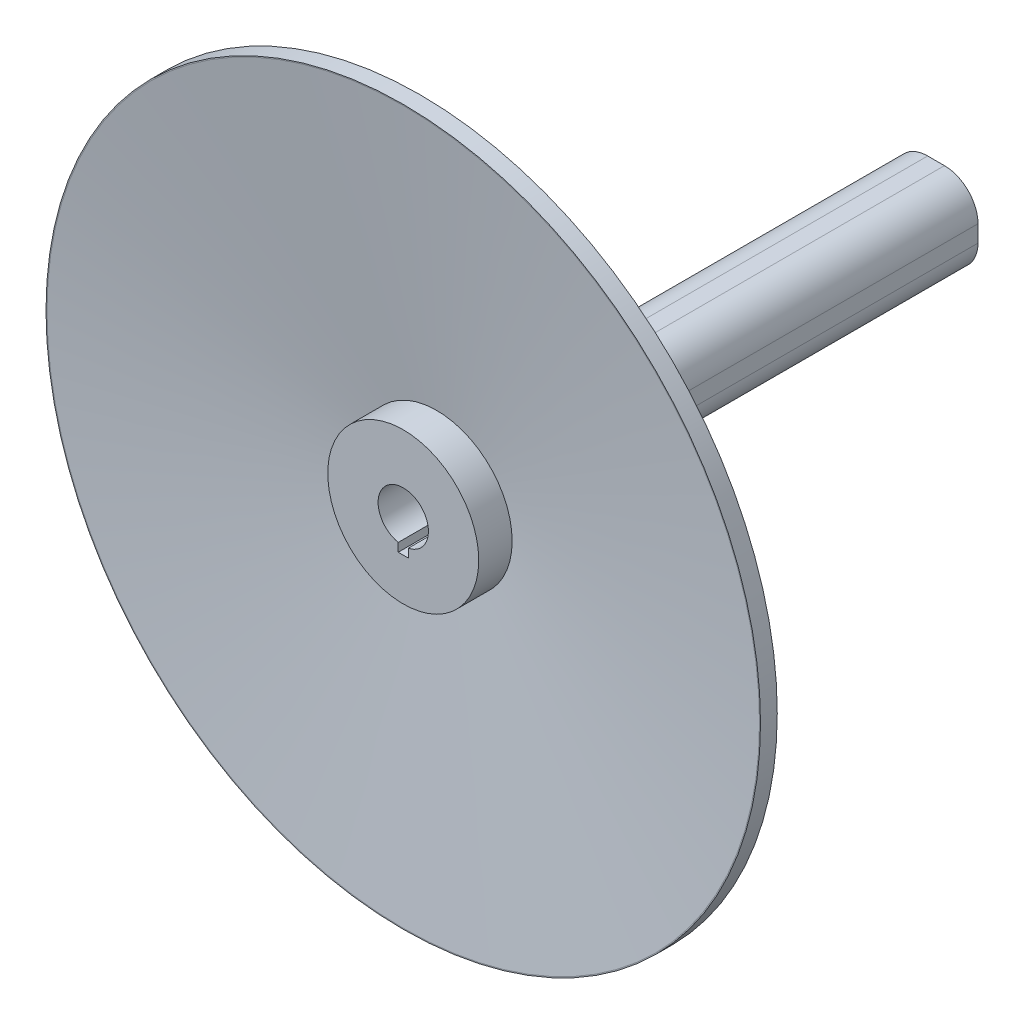
ISO-10303-21;
HEADER;
FILE_DESCRIPTION(('STEP AP214'),'2;1');
FILE_NAME('part.step','',(''),(''),'','','');
FILE_SCHEMA(('AUTOMOTIVE_DESIGN { 1 0 10303 214 1 1 1 1 }'));
ENDSEC;
DATA;
#1=APPLICATION_CONTEXT('core data for automotive mechanical design processes');
#2=APPLICATION_PROTOCOL_DEFINITION('international standard','automotive_design',2000,#1);
#3=PRODUCT_CONTEXT('',#1,'mechanical');
#4=PRODUCT('Part','Part','',(#3));
#5=PRODUCT_RELATED_PRODUCT_CATEGORY('part','',(#4));
#6=PRODUCT_DEFINITION_FORMATION('','',#4);
#7=PRODUCT_DEFINITION_CONTEXT('part definition',#1,'design');
#8=PRODUCT_DEFINITION('design','',#6,#7);
#9=PRODUCT_DEFINITION_SHAPE('','',#8);
#10=(LENGTH_UNIT() NAMED_UNIT(*) SI_UNIT(.MILLI.,.METRE.));
#11=(NAMED_UNIT(*) PLANE_ANGLE_UNIT() SI_UNIT($,.RADIAN.));
#12=(NAMED_UNIT(*) SI_UNIT($,.STERADIAN.) SOLID_ANGLE_UNIT());
#13=UNCERTAINTY_MEASURE_WITH_UNIT(LENGTH_MEASURE(1.E-05),#10,'distance_accuracy_value','');
#14=(GEOMETRIC_REPRESENTATION_CONTEXT(3) GLOBAL_UNCERTAINTY_ASSIGNED_CONTEXT((#13)) GLOBAL_UNIT_ASSIGNED_CONTEXT((#10,
#11,#12)) REPRESENTATION_CONTEXT('',''));
#15=CARTESIAN_POINT('',(0.,0.,0.));
#16=DIRECTION('',(0.,0.,1.));
#17=DIRECTION('',(1.,0.,0.));
#18=AXIS2_PLACEMENT_3D('',#15,#16,#17);
#19=CARTESIAN_POINT('',(0.,0.,60.));
#20=DIRECTION('',(0.,0.,1.));
#21=DIRECTION('',(1.,0.,0.));
#22=AXIS2_PLACEMENT_3D('',#19,#20,#21);
#23=PLANE('',#22);
#24=CARTESIAN_POINT('',(0.,0.,60.));
#25=DIRECTION('',(0.,0.,1.));
#26=DIRECTION('',(1.,0.,0.));
#27=AXIS2_PLACEMENT_3D('',#24,#25,#26);
#28=CIRCLE('',#27,22.5);
#29=CARTESIAN_POINT('',(22.5,0.,60.));
#30=VERTEX_POINT('',#29);
#31=EDGE_CURVE('E47',#30,#30,#28,.T.);
#32=ORIENTED_EDGE('',*,*,#31,.T.);
#33=EDGE_LOOP('',(#32));
#34=FACE_BOUND('',#33,.T.);
#35=CARTESIAN_POINT('',(0.,0.,60.));
#36=DIRECTION('',(0.,0.,-1.));
#37=DIRECTION('',(-1.,0.,0.));
#38=AXIS2_PLACEMENT_3D('',#35,#36,#37);
#39=CIRCLE('',#38,7.5);
#40=CARTESIAN_POINT('',(-1.5,-7.34846922834953,60.));
#41=VERTEX_POINT('',#40);
#42=CARTESIAN_POINT('',(1.5,-7.34846922834953,60.));
#43=VERTEX_POINT('',#42);
#44=EDGE_CURVE('E147',#41,#43,#39,.T.);
#45=ORIENTED_EDGE('',*,*,#44,.T.);
#46=DIRECTION('',(0.,-1.,0.));
#47=VECTOR('',#46,1.);
#48=CARTESIAN_POINT('',(1.5,0.,60.));
#49=LINE('',#48,#47);
#50=CARTESIAN_POINT('',(1.5,-9.88685996664259,60.));
#51=VERTEX_POINT('',#50);
#52=EDGE_CURVE('E483',#43,#51,#49,.T.);
#53=ORIENTED_EDGE('',*,*,#52,.T.);
#54=DIRECTION('',(1.,0.,0.));
#55=VECTOR('',#54,1.);
#56=CARTESIAN_POINT('',(0.,-9.88685996664259,60.));
#57=LINE('',#56,#55);
#58=CARTESIAN_POINT('',(-1.5,-9.88685996664259,60.));
#59=VERTEX_POINT('',#58);
#60=EDGE_CURVE('E479',#59,#51,#57,.T.);
#61=ORIENTED_EDGE('',*,*,#60,.F.);
#62=DIRECTION('',(0.,-1.,0.));
#63=VECTOR('',#62,1.);
#64=CARTESIAN_POINT('',(-1.5,0.,60.));
#65=LINE('',#64,#63);
#66=EDGE_CURVE('E481',#41,#59,#65,.T.);
#67=ORIENTED_EDGE('',*,*,#66,.F.);
#68=EDGE_LOOP('',(#45,#53,#61,#67));
#69=FACE_BOUND('',#68,.T.);
#70=ADVANCED_FACE('F39',(#34,#69),#23,.T.);
#71=CARTESIAN_POINT('',(0.,0.,60.));
#72=DIRECTION('',(0.,0.,-1.));
#73=DIRECTION('',(-1.,0.,0.));
#74=AXIS2_PLACEMENT_3D('',#71,#72,#73);
#75=CYLINDRICAL_SURFACE('',#74,7.5);
#76=CARTESIAN_POINT('',(0.,0.,-98.836337037247));
#77=DIRECTION('',(0.,0.,-1.));
#78=DIRECTION('',(-1.,0.,0.));
#79=AXIS2_PLACEMENT_3D('',#76,#77,#78);
#80=CIRCLE('',#79,7.5);
#81=CARTESIAN_POINT('',(-7.5,0.,-98.836337037247));
#82=VERTEX_POINT('',#81);
#83=EDGE_CURVE('E157',#82,#82,#80,.T.);
#84=ORIENTED_EDGE('',*,*,#83,.T.);
#85=EDGE_LOOP('',(#84));
#86=FACE_BOUND('',#85,.T.);
#87=DIRECTION('',(0.,0.,1.));
#88=VECTOR('',#87,1.);
#89=CARTESIAN_POINT('',(1.5,-7.34846922834953,9.99999999999999));
#90=LINE('',#89,#88);
#91=CARTESIAN_POINT('',(1.5,-7.34846922834953,9.99999999999999));
#92=VERTEX_POINT('',#91);
#93=EDGE_CURVE('E148',#92,#43,#90,.T.);
#94=ORIENTED_EDGE('',*,*,#93,.T.);
#95=ORIENTED_EDGE('',*,*,#44,.F.);
#96=DIRECTION('',(0.,0.,1.));
#97=VECTOR('',#96,1.);
#98=CARTESIAN_POINT('',(-1.5,-7.34846922834953,9.99999999999999));
#99=LINE('',#98,#97);
#100=CARTESIAN_POINT('',(-1.5,-7.34846922834953,9.99999999999999));
#101=VERTEX_POINT('',#100);
#102=EDGE_CURVE('E132',#101,#41,#99,.T.);
#103=ORIENTED_EDGE('',*,*,#102,.F.);
#104=CARTESIAN_POINT('',(0.,0.,9.99999999999999));
#105=DIRECTION('',(0.,0.,1.));
#106=DIRECTION('',(1.,0.,0.));
#107=AXIS2_PLACEMENT_3D('',#104,#105,#106);
#108=CIRCLE('',#107,7.5);
#109=EDGE_CURVE('E137',#92,#101,#108,.F.);
#110=ORIENTED_EDGE('',*,*,#109,.F.);
#111=EDGE_LOOP('',(#94,#95,#103,#110));
#112=FACE_BOUND('',#111,.T.);
#113=ADVANCED_FACE('F145',(#86,#112),#75,.F.);
#114=CARTESIAN_POINT('',(0.,0.,0.));
#115=DIRECTION('',(0.,0.,1.));
#116=DIRECTION('',(1.,0.,0.));
#117=AXIS2_PLACEMENT_3D('',#114,#115,#116);
#118=PLANE('',#117);
#119=CARTESIAN_POINT('',(0.,0.,0.));
#120=DIRECTION('',(0.,0.,1.));
#121=DIRECTION('',(1.,0.,0.));
#122=AXIS2_PLACEMENT_3D('',#119,#120,#121);
#123=CIRCLE('',#122,22.5);
#124=CARTESIAN_POINT('',(22.5,0.,0.));
#125=VERTEX_POINT('',#124);
#126=EDGE_CURVE('E233',#125,#125,#123,.T.);
#127=ORIENTED_EDGE('',*,*,#126,.F.);
#128=EDGE_LOOP('',(#127));
#129=FACE_BOUND('',#128,.T.);
#130=CARTESIAN_POINT('',(2.5,-2.5,0.));
#131=DIRECTION('',(0.,0.,-1.));
#132=DIRECTION('',(-1.,0.,0.));
#133=AXIS2_PLACEMENT_3D('',#130,#131,#132);
#134=CIRCLE('',#133,10.);
#135=CARTESIAN_POINT('',(12.5,-2.49999999999993,0.));
#136=VERTEX_POINT('',#135);
#137=CARTESIAN_POINT('',(2.49999999999993,-12.5,0.));
#138=VERTEX_POINT('',#137);
#139=EDGE_CURVE('E62',#136,#138,#134,.T.);
#140=ORIENTED_EDGE('',*,*,#139,.F.);
#141=DIRECTION('',(0.,-1.,0.));
#142=VECTOR('',#141,1.);
#143=CARTESIAN_POINT('',(12.5,2.49999999999993,0.));
#144=LINE('',#143,#142);
#145=CARTESIAN_POINT('',(12.5,2.49999999999993,0.));
#146=VERTEX_POINT('',#145);
#147=EDGE_CURVE('E175',#146,#136,#144,.T.);
#148=ORIENTED_EDGE('',*,*,#147,.F.);
#149=CARTESIAN_POINT('',(2.5,2.5,0.));
#150=DIRECTION('',(0.,0.,-1.));
#151=DIRECTION('',(-1.,0.,0.));
#152=AXIS2_PLACEMENT_3D('',#149,#150,#151);
#153=CIRCLE('',#152,10.);
#154=CARTESIAN_POINT('',(2.49999999999993,12.5,0.));
#155=VERTEX_POINT('',#154);
#156=EDGE_CURVE('E206',#155,#146,#153,.T.);
#157=ORIENTED_EDGE('',*,*,#156,.F.);
#158=DIRECTION('',(1.,0.,0.));
#159=VECTOR('',#158,1.);
#160=CARTESIAN_POINT('',(2.49999999999993,12.5,0.));
#161=LINE('',#160,#159);
#162=CARTESIAN_POINT('',(-2.49999999999993,12.5,0.));
#163=VERTEX_POINT('',#162);
#164=EDGE_CURVE('E203',#163,#155,#161,.T.);
#165=ORIENTED_EDGE('',*,*,#164,.F.);
#166=CARTESIAN_POINT('',(-2.5,2.5,0.));
#167=DIRECTION('',(0.,0.,-1.));
#168=DIRECTION('',(1.,0.,0.));
#169=AXIS2_PLACEMENT_3D('',#166,#167,#168);
#170=CIRCLE('',#169,10.);
#171=CARTESIAN_POINT('',(-12.5,2.49999999999994,0.));
#172=VERTEX_POINT('',#171);
#173=EDGE_CURVE('E200',#172,#163,#170,.T.);
#174=ORIENTED_EDGE('',*,*,#173,.F.);
#175=DIRECTION('',(0.,1.,0.));
#176=VECTOR('',#175,1.);
#177=CARTESIAN_POINT('',(-12.5,2.49999999999993,0.));
#178=LINE('',#177,#176);
#179=CARTESIAN_POINT('',(-12.5,-2.49999999999993,0.));
#180=VERTEX_POINT('',#179);
#181=EDGE_CURVE('E197',#180,#172,#178,.T.);
#182=ORIENTED_EDGE('',*,*,#181,.F.);
#183=CARTESIAN_POINT('',(-2.5,-2.5,0.));
#184=DIRECTION('',(0.,0.,-1.));
#185=DIRECTION('',(-1.,0.,0.));
#186=AXIS2_PLACEMENT_3D('',#183,#184,#185);
#187=CIRCLE('',#186,10.);
#188=CARTESIAN_POINT('',(-2.49999999999993,-12.5,0.));
#189=VERTEX_POINT('',#188);
#190=EDGE_CURVE('E194',#189,#180,#187,.T.);
#191=ORIENTED_EDGE('',*,*,#190,.F.);
#192=DIRECTION('',(-1.,0.,0.));
#193=VECTOR('',#192,1.);
#194=CARTESIAN_POINT('',(2.49999999999993,-12.5,0.));
#195=LINE('',#194,#193);
#196=EDGE_CURVE('E191',#138,#189,#195,.T.);
#197=ORIENTED_EDGE('',*,*,#196,.F.);
#198=EDGE_LOOP('',(#140,#148,#157,#165,#174,#182,#191,#197));
#199=FACE_BOUND('',#198,.T.);
#200=ADVANCED_FACE('F239',(#129,#199),#118,.F.);
#201=CARTESIAN_POINT('',(0.,0.,60.));
#202=DIRECTION('',(0.,0.,-1.));
#203=DIRECTION('',(-1.,0.,0.));
#204=AXIS2_PLACEMENT_3D('',#201,#202,#203);
#205=CYLINDRICAL_SURFACE('',#204,22.5);
#206=CARTESIAN_POINT('',(0.,0.,45.));
#207=DIRECTION('',(0.,0.,1.));
#208=DIRECTION('',(1.,0.,0.));
#209=AXIS2_PLACEMENT_3D('',#206,#207,#208);
#210=CIRCLE('',#209,22.5);
#211=CARTESIAN_POINT('',(22.5,0.,45.));
#212=VERTEX_POINT('',#211);
#213=EDGE_CURVE('E165',#212,#212,#210,.T.);
#214=ORIENTED_EDGE('',*,*,#213,.F.);
#215=EDGE_LOOP('',(#214));
#216=FACE_BOUND('',#215,.T.);
#217=ORIENTED_EDGE('',*,*,#126,.T.);
#218=EDGE_LOOP('',(#217));
#219=FACE_BOUND('',#218,.T.);
#220=ADVANCED_FACE('F41',(#216,#219),#205,.T.);
#221=CARTESIAN_POINT('',(2.5,-2.5,-98.836337037247));
#222=DIRECTION('',(0.,0.,1.));
#223=DIRECTION('',(1.,0.,0.));
#224=AXIS2_PLACEMENT_3D('',#221,#222,#223);
#225=CYLINDRICAL_SURFACE('',#224,10.);
#226=ORIENTED_EDGE('',*,*,#139,.T.);
#227=DIRECTION('',(0.,0.,1.));
#228=VECTOR('',#227,1.);
#229=CARTESIAN_POINT('',(2.49999999999993,-12.5,-98.836337037247));
#230=LINE('',#229,#228);
#231=CARTESIAN_POINT('',(2.49999999999993,-12.5,-98.836337037247));
#232=VERTEX_POINT('',#231);
#233=EDGE_CURVE('E230',#232,#138,#230,.T.);
#234=ORIENTED_EDGE('',*,*,#233,.F.);
#235=CARTESIAN_POINT('',(2.5,-2.5,-98.836337037247));
#236=DIRECTION('',(0.,0.,-1.));
#237=DIRECTION('',(-1.,0.,0.));
#238=AXIS2_PLACEMENT_3D('',#235,#236,#237);
#239=CIRCLE('',#238,10.);
#240=CARTESIAN_POINT('',(12.5,-2.49999999999993,-98.836337037247));
#241=VERTEX_POINT('',#240);
#242=EDGE_CURVE('E171',#241,#232,#239,.T.);
#243=ORIENTED_EDGE('',*,*,#242,.F.);
#244=DIRECTION('',(0.,0.,1.));
#245=VECTOR('',#244,1.);
#246=CARTESIAN_POINT('',(12.5,-2.49999999999993,-98.836337037247));
#247=LINE('',#246,#245);
#248=EDGE_CURVE('E189',#241,#136,#247,.T.);
#249=ORIENTED_EDGE('',*,*,#248,.T.);
#250=EDGE_LOOP('',(#226,#234,#243,#249));
#251=FACE_BOUND('',#250,.T.);
#252=ADVANCED_FACE('F245',(#251),#225,.T.);
#253=CARTESIAN_POINT('',(2.49999999999993,-12.5,-98.836337037247));
#254=DIRECTION('',(0.,1.,0.));
#255=DIRECTION('',(0.,0.,1.));
#256=AXIS2_PLACEMENT_3D('',#253,#254,#255);
#257=PLANE('',#256);
#258=ORIENTED_EDGE('',*,*,#196,.T.);
#259=DIRECTION('',(0.,0.,1.));
#260=VECTOR('',#259,1.);
#261=CARTESIAN_POINT('',(-2.49999999999993,-12.5,-98.836337037247));
#262=LINE('',#261,#260);
#263=CARTESIAN_POINT('',(-2.49999999999993,-12.5,-98.836337037247));
#264=VERTEX_POINT('',#263);
#265=EDGE_CURVE('E227',#264,#189,#262,.T.);
#266=ORIENTED_EDGE('',*,*,#265,.F.);
#267=DIRECTION('',(-1.,0.,0.));
#268=VECTOR('',#267,1.);
#269=CARTESIAN_POINT('',(2.49999999999993,-12.5,-98.836337037247));
#270=LINE('',#269,#268);
#271=EDGE_CURVE('E174',#232,#264,#270,.T.);
#272=ORIENTED_EDGE('',*,*,#271,.F.);
#273=ORIENTED_EDGE('',*,*,#233,.T.);
#274=EDGE_LOOP('',(#258,#266,#272,#273));
#275=FACE_BOUND('',#274,.T.);
#276=ADVANCED_FACE('F259',(#275),#257,.F.);
#277=CARTESIAN_POINT('',(-2.5,-2.5,-98.836337037247));
#278=DIRECTION('',(0.,0.,1.));
#279=DIRECTION('',(1.,0.,0.));
#280=AXIS2_PLACEMENT_3D('',#277,#278,#279);
#281=CYLINDRICAL_SURFACE('',#280,10.);
#282=ORIENTED_EDGE('',*,*,#190,.T.);
#283=DIRECTION('',(0.,0.,1.));
#284=VECTOR('',#283,1.);
#285=CARTESIAN_POINT('',(-12.5,-2.49999999999993,-98.836337037247));
#286=LINE('',#285,#284);
#287=CARTESIAN_POINT('',(-12.5,-2.49999999999993,-98.836337037247));
#288=VERTEX_POINT('',#287);
#289=EDGE_CURVE('E224',#288,#180,#286,.T.);
#290=ORIENTED_EDGE('',*,*,#289,.F.);
#291=CARTESIAN_POINT('',(-2.5,-2.5,-98.836337037247));
#292=DIRECTION('',(0.,0.,-1.));
#293=DIRECTION('',(-1.,0.,0.));
#294=AXIS2_PLACEMENT_3D('',#291,#292,#293);
#295=CIRCLE('',#294,10.);
#296=EDGE_CURVE('E177',#264,#288,#295,.T.);
#297=ORIENTED_EDGE('',*,*,#296,.F.);
#298=ORIENTED_EDGE('',*,*,#265,.T.);
#299=EDGE_LOOP('',(#282,#290,#297,#298));
#300=FACE_BOUND('',#299,.T.);
#301=ADVANCED_FACE('F263',(#300),#281,.T.);
#302=CARTESIAN_POINT('',(-12.5,2.49999999999993,-98.836337037247));
#303=DIRECTION('',(1.,0.,0.));
#304=DIRECTION('',(0.,0.,-1.));
#305=AXIS2_PLACEMENT_3D('',#302,#303,#304);
#306=PLANE('',#305);
#307=ORIENTED_EDGE('',*,*,#181,.T.);
#308=DIRECTION('',(0.,0.,1.));
#309=VECTOR('',#308,1.);
#310=CARTESIAN_POINT('',(-12.5,2.49999999999994,-98.836337037247));
#311=LINE('',#310,#309);
#312=CARTESIAN_POINT('',(-12.5,2.49999999999994,-98.836337037247));
#313=VERTEX_POINT('',#312);
#314=EDGE_CURVE('E221',#313,#172,#311,.T.);
#315=ORIENTED_EDGE('',*,*,#314,.F.);
#316=DIRECTION('',(0.,1.,0.));
#317=VECTOR('',#316,1.);
#318=CARTESIAN_POINT('',(-12.5,2.49999999999993,-98.836337037247));
#319=LINE('',#318,#317);
#320=EDGE_CURVE('E179',#288,#313,#319,.T.);
#321=ORIENTED_EDGE('',*,*,#320,.F.);
#322=ORIENTED_EDGE('',*,*,#289,.T.);
#323=EDGE_LOOP('',(#307,#315,#321,#322));
#324=FACE_BOUND('',#323,.T.);
#325=ADVANCED_FACE('F267',(#324),#306,.F.);
#326=CARTESIAN_POINT('',(-2.5,2.5,-98.836337037247));
#327=DIRECTION('',(0.,0.,1.));
#328=DIRECTION('',(1.,0.,0.));
#329=AXIS2_PLACEMENT_3D('',#326,#327,#328);
#330=CYLINDRICAL_SURFACE('',#329,10.);
#331=ORIENTED_EDGE('',*,*,#173,.T.);
#332=DIRECTION('',(0.,0.,1.));
#333=VECTOR('',#332,1.);
#334=CARTESIAN_POINT('',(-2.49999999999993,12.5,-98.836337037247));
#335=LINE('',#334,#333);
#336=CARTESIAN_POINT('',(-2.49999999999993,12.5,-98.836337037247));
#337=VERTEX_POINT('',#336);
#338=EDGE_CURVE('E218',#337,#163,#335,.T.);
#339=ORIENTED_EDGE('',*,*,#338,.F.);
#340=CARTESIAN_POINT('',(-2.5,2.5,-98.836337037247));
#341=DIRECTION('',(0.,0.,-1.));
#342=DIRECTION('',(1.,0.,0.));
#343=AXIS2_PLACEMENT_3D('',#340,#341,#342);
#344=CIRCLE('',#343,10.);
#345=EDGE_CURVE('E181',#313,#337,#344,.T.);
#346=ORIENTED_EDGE('',*,*,#345,.F.);
#347=ORIENTED_EDGE('',*,*,#314,.T.);
#348=EDGE_LOOP('',(#331,#339,#346,#347));
#349=FACE_BOUND('',#348,.T.);
#350=ADVANCED_FACE('F271',(#349),#330,.T.);
#351=CARTESIAN_POINT('',(2.49999999999993,12.5,-98.836337037247));
#352=DIRECTION('',(0.,-1.,0.));
#353=DIRECTION('',(0.,0.,-1.));
#354=AXIS2_PLACEMENT_3D('',#351,#352,#353);
#355=PLANE('',#354);
#356=ORIENTED_EDGE('',*,*,#164,.T.);
#357=DIRECTION('',(0.,0.,1.));
#358=VECTOR('',#357,1.);
#359=CARTESIAN_POINT('',(2.49999999999993,12.5,-98.836337037247));
#360=LINE('',#359,#358);
#361=CARTESIAN_POINT('',(2.49999999999993,12.5,-98.836337037247));
#362=VERTEX_POINT('',#361);
#363=EDGE_CURVE('E215',#362,#155,#360,.T.);
#364=ORIENTED_EDGE('',*,*,#363,.F.);
#365=DIRECTION('',(1.,0.,0.));
#366=VECTOR('',#365,1.);
#367=CARTESIAN_POINT('',(2.49999999999993,12.5,-98.836337037247));
#368=LINE('',#367,#366);
#369=EDGE_CURVE('E183',#337,#362,#368,.T.);
#370=ORIENTED_EDGE('',*,*,#369,.F.);
#371=ORIENTED_EDGE('',*,*,#338,.T.);
#372=EDGE_LOOP('',(#356,#364,#370,#371));
#373=FACE_BOUND('',#372,.T.);
#374=ADVANCED_FACE('F275',(#373),#355,.F.);
#375=CARTESIAN_POINT('',(2.5,2.5,-98.836337037247));
#376=DIRECTION('',(0.,0.,1.));
#377=DIRECTION('',(1.,0.,0.));
#378=AXIS2_PLACEMENT_3D('',#375,#376,#377);
#379=CYLINDRICAL_SURFACE('',#378,10.);
#380=ORIENTED_EDGE('',*,*,#156,.T.);
#381=DIRECTION('',(0.,0.,1.));
#382=VECTOR('',#381,1.);
#383=CARTESIAN_POINT('',(12.5,2.49999999999993,-98.836337037247));
#384=LINE('',#383,#382);
#385=CARTESIAN_POINT('',(12.5,2.49999999999993,-98.836337037247));
#386=VERTEX_POINT('',#385);
#387=EDGE_CURVE('E212',#386,#146,#384,.T.);
#388=ORIENTED_EDGE('',*,*,#387,.F.);
#389=CARTESIAN_POINT('',(2.5,2.5,-98.836337037247));
#390=DIRECTION('',(0.,0.,-1.));
#391=DIRECTION('',(-1.,0.,0.));
#392=AXIS2_PLACEMENT_3D('',#389,#390,#391);
#393=CIRCLE('',#392,10.);
#394=EDGE_CURVE('E185',#362,#386,#393,.T.);
#395=ORIENTED_EDGE('',*,*,#394,.F.);
#396=ORIENTED_EDGE('',*,*,#363,.T.);
#397=EDGE_LOOP('',(#380,#388,#395,#396));
#398=FACE_BOUND('',#397,.T.);
#399=ADVANCED_FACE('F279',(#398),#379,.T.);
#400=CARTESIAN_POINT('',(12.5,2.49999999999993,-98.836337037247));
#401=DIRECTION('',(-1.,0.,0.));
#402=DIRECTION('',(0.,0.,1.));
#403=AXIS2_PLACEMENT_3D('',#400,#401,#402);
#404=PLANE('',#403);
#405=ORIENTED_EDGE('',*,*,#147,.T.);
#406=ORIENTED_EDGE('',*,*,#248,.F.);
#407=DIRECTION('',(0.,-1.,0.));
#408=VECTOR('',#407,1.);
#409=CARTESIAN_POINT('',(12.5,2.49999999999993,-98.836337037247));
#410=LINE('',#409,#408);
#411=EDGE_CURVE('E187',#386,#241,#410,.T.);
#412=ORIENTED_EDGE('',*,*,#411,.F.);
#413=ORIENTED_EDGE('',*,*,#387,.T.);
#414=EDGE_LOOP('',(#405,#406,#412,#413));
#415=FACE_BOUND('',#414,.T.);
#416=ADVANCED_FACE('F283',(#415),#404,.F.);
#417=CARTESIAN_POINT('',(2.5,-2.5,-98.836337037247));
#418=DIRECTION('',(0.,0.,-1.));
#419=DIRECTION('',(-1.,0.,0.));
#420=AXIS2_PLACEMENT_3D('',#417,#418,#419);
#421=PLANE('',#420);
#422=ORIENTED_EDGE('',*,*,#83,.F.);
#423=EDGE_LOOP('',(#422));
#424=FACE_BOUND('',#423,.T.);
#425=ORIENTED_EDGE('',*,*,#242,.T.);
#426=ORIENTED_EDGE('',*,*,#271,.T.);
#427=ORIENTED_EDGE('',*,*,#296,.T.);
#428=ORIENTED_EDGE('',*,*,#320,.T.);
#429=ORIENTED_EDGE('',*,*,#345,.T.);
#430=ORIENTED_EDGE('',*,*,#369,.T.);
#431=ORIENTED_EDGE('',*,*,#394,.T.);
#432=ORIENTED_EDGE('',*,*,#411,.T.);
#433=EDGE_LOOP('',(#425,#426,#427,#428,#429,#430,#431,#432));
#434=FACE_BOUND('',#433,.T.);
#435=ADVANCED_FACE('F287',(#424,#434),#421,.T.);
#436=CARTESIAN_POINT('',(0.,0.,60.));
#437=DIRECTION('',(0.,0.,1.));
#438=DIRECTION('',(1.,0.,0.));
#439=AXIS2_PLACEMENT_3D('',#436,#437,#438);
#440=PLANE('',#439);
#441=CARTESIAN_POINT('',(0.,0.,60.));
#442=DIRECTION('',(0.,0.,1.));
#443=DIRECTION('',(1.,0.,0.));
#444=AXIS2_PLACEMENT_3D('',#441,#442,#443);
#445=CIRCLE('',#444,106.5);
#446=CARTESIAN_POINT('',(106.5,0.,60.));
#447=VERTEX_POINT('',#446);
#448=EDGE_CURVE('E156',#447,#447,#445,.T.);
#449=ORIENTED_EDGE('',*,*,#448,.T.);
#450=EDGE_LOOP('',(#449));
#451=FACE_BOUND('',#450,.T.);
#452=CARTESIAN_POINT('',(0.,0.,60.));
#453=DIRECTION('',(0.,0.,1.));
#454=DIRECTION('',(1.,0.,0.));
#455=AXIS2_PLACEMENT_3D('',#452,#453,#454);
#456=CIRCLE('',#455,106.203428034887);
#457=CARTESIAN_POINT('',(106.203428034887,0.,60.));
#458=VERTEX_POINT('',#457);
#459=EDGE_CURVE('E168',#458,#458,#456,.T.);
#460=ORIENTED_EDGE('',*,*,#459,.F.);
#461=EDGE_LOOP('',(#460));
#462=FACE_BOUND('',#461,.T.);
#463=ADVANCED_FACE('F291',(#451,#462),#440,.T.);
#464=CARTESIAN_POINT('',(0.,0.,60.));
#465=DIRECTION('',(0.,0.,1.));
#466=DIRECTION('',(1.,0.,0.));
#467=AXIS2_PLACEMENT_3D('',#464,#465,#466);
#468=CONICAL_SURFACE('',#467,106.203428034887,1.45230636763676);
#469=CARTESIAN_POINT('',(0.,0.,50.035306186323));
#470=DIRECTION('',(0.,0.,1.));
#471=DIRECTION('',(1.,0.,0.));
#472=AXIS2_PLACEMENT_3D('',#469,#470,#471);
#473=CIRCLE('',#472,22.5);
#474=CARTESIAN_POINT('',(22.5,0.,50.035306186323));
#475=VERTEX_POINT('',#474);
#476=EDGE_CURVE('E11',#475,#475,#473,.F.);
#477=ORIENTED_EDGE('',*,*,#476,.T.);
#478=EDGE_LOOP('',(#477));
#479=FACE_BOUND('',#478,.T.);
#480=ORIENTED_EDGE('',*,*,#459,.T.);
#481=EDGE_LOOP('',(#480));
#482=FACE_BOUND('',#481,.T.);
#483=ADVANCED_FACE('F295',(#479,#482),#468,.F.);
#484=CARTESIAN_POINT('',(0.,0.,55.));
#485=DIRECTION('',(0.,0.,1.));
#486=DIRECTION('',(1.,0.,0.));
#487=AXIS2_PLACEMENT_3D('',#484,#485,#486);
#488=CONICAL_SURFACE('',#487,106.5,1.45230636763676);
#489=ORIENTED_EDGE('',*,*,#213,.T.);
#490=EDGE_LOOP('',(#489));
#491=FACE_BOUND('',#490,.T.);
#492=CARTESIAN_POINT('',(0.,0.,55.));
#493=DIRECTION('',(0.,0.,1.));
#494=DIRECTION('',(1.,0.,0.));
#495=AXIS2_PLACEMENT_3D('',#492,#493,#494);
#496=CIRCLE('',#495,106.5);
#497=CARTESIAN_POINT('',(106.5,0.,55.));
#498=VERTEX_POINT('',#497);
#499=EDGE_CURVE('E162',#498,#498,#496,.T.);
#500=ORIENTED_EDGE('',*,*,#499,.F.);
#501=EDGE_LOOP('',(#500));
#502=FACE_BOUND('',#501,.T.);
#503=ADVANCED_FACE('F299',(#491,#502),#488,.T.);
#504=CARTESIAN_POINT('',(0.,0.,60.));
#505=DIRECTION('',(0.,0.,1.));
#506=DIRECTION('',(1.,0.,0.));
#507=AXIS2_PLACEMENT_3D('',#504,#505,#506);
#508=CYLINDRICAL_SURFACE('',#507,106.5);
#509=ORIENTED_EDGE('',*,*,#499,.T.);
#510=EDGE_LOOP('',(#509));
#511=FACE_BOUND('',#510,.T.);
#512=ORIENTED_EDGE('',*,*,#448,.F.);
#513=EDGE_LOOP('',(#512));
#514=FACE_BOUND('',#513,.T.);
#515=ADVANCED_FACE('F303',(#511,#514),#508,.T.);
#516=ORIENTED_EDGE('',*,*,#31,.F.);
#517=EDGE_LOOP('',(#516));
#518=FACE_BOUND('',#517,.T.);
#519=ORIENTED_EDGE('',*,*,#476,.F.);
#520=EDGE_LOOP('',(#519));
#521=FACE_BOUND('',#520,.T.);
#522=ADVANCED_FACE('F247',(#518,#521),#205,.T.);
#523=CARTESIAN_POINT('',(1.5,0.,9.99999999999999));
#524=DIRECTION('',(-1.,0.,0.));
#525=DIRECTION('',(0.,-1.,0.));
#526=AXIS2_PLACEMENT_3D('',#523,#524,#525);
#527=PLANE('',#526);
#528=ORIENTED_EDGE('',*,*,#52,.F.);
#529=ORIENTED_EDGE('',*,*,#93,.F.);
#530=DIRECTION('',(0.,-1.,0.));
#531=VECTOR('',#530,1.);
#532=CARTESIAN_POINT('',(1.5,0.,9.99999999999999));
#533=LINE('',#532,#531);
#534=CARTESIAN_POINT('',(1.5,-9.88685996664259,9.99999999999999));
#535=VERTEX_POINT('',#534);
#536=EDGE_CURVE('E54',#92,#535,#533,.T.);
#537=ORIENTED_EDGE('',*,*,#536,.T.);
#538=DIRECTION('',(0.,0.,1.));
#539=VECTOR('',#538,1.);
#540=CARTESIAN_POINT('',(1.5,-9.88685996664259,9.99999999999999));
#541=LINE('',#540,#539);
#542=EDGE_CURVE('E150',#535,#51,#541,.T.);
#543=ORIENTED_EDGE('',*,*,#542,.T.);
#544=EDGE_LOOP('',(#528,#529,#537,#543));
#545=FACE_BOUND('',#544,.T.);
#546=ADVANCED_FACE('F308',(#545),#527,.T.);
#547=CARTESIAN_POINT('',(0.,-9.88685996664259,9.99999999999999));
#548=DIRECTION('',(0.,-1.,0.));
#549=DIRECTION('',(0.,0.,-1.));
#550=AXIS2_PLACEMENT_3D('',#547,#548,#549);
#551=PLANE('',#550);
#552=ORIENTED_EDGE('',*,*,#60,.T.);
#553=ORIENTED_EDGE('',*,*,#542,.F.);
#554=DIRECTION('',(1.,0.,0.));
#555=VECTOR('',#554,1.);
#556=CARTESIAN_POINT('',(0.,-9.88685996664259,9.99999999999999));
#557=LINE('',#556,#555);
#558=CARTESIAN_POINT('',(-1.5,-9.88685996664259,9.99999999999999));
#559=VERTEX_POINT('',#558);
#560=EDGE_CURVE('E136',#559,#535,#557,.T.);
#561=ORIENTED_EDGE('',*,*,#560,.F.);
#562=DIRECTION('',(0.,0.,1.));
#563=VECTOR('',#562,1.);
#564=CARTESIAN_POINT('',(-1.5,-9.88685996664259,9.99999999999999));
#565=LINE('',#564,#563);
#566=EDGE_CURVE('E134',#559,#59,#565,.T.);
#567=ORIENTED_EDGE('',*,*,#566,.T.);
#568=EDGE_LOOP('',(#552,#553,#561,#567));
#569=FACE_BOUND('',#568,.T.);
#570=ADVANCED_FACE('F311',(#569),#551,.F.);
#571=CARTESIAN_POINT('',(-1.5,0.,9.99999999999999));
#572=DIRECTION('',(-1.,0.,0.));
#573=DIRECTION('',(0.,-1.,0.));
#574=AXIS2_PLACEMENT_3D('',#571,#572,#573);
#575=PLANE('',#574);
#576=ORIENTED_EDGE('',*,*,#66,.T.);
#577=ORIENTED_EDGE('',*,*,#566,.F.);
#578=DIRECTION('',(0.,-1.,0.));
#579=VECTOR('',#578,1.);
#580=CARTESIAN_POINT('',(-1.5,0.,9.99999999999999));
#581=LINE('',#580,#579);
#582=EDGE_CURVE('E128',#101,#559,#581,.T.);
#583=ORIENTED_EDGE('',*,*,#582,.F.);
#584=ORIENTED_EDGE('',*,*,#102,.T.);
#585=EDGE_LOOP('',(#576,#577,#583,#584));
#586=FACE_BOUND('',#585,.T.);
#587=ADVANCED_FACE('F130',(#586),#575,.F.);
#588=CARTESIAN_POINT('',(0.,0.,9.99999999999999));
#589=DIRECTION('',(0.,0.,1.));
#590=DIRECTION('',(1.,0.,0.));
#591=AXIS2_PLACEMENT_3D('',#588,#589,#590);
#592=PLANE('',#591);
#593=ORIENTED_EDGE('',*,*,#536,.F.);
#594=ORIENTED_EDGE('',*,*,#109,.T.);
#595=ORIENTED_EDGE('',*,*,#582,.T.);
#596=ORIENTED_EDGE('',*,*,#560,.T.);
#597=EDGE_LOOP('',(#593,#594,#595,#596));
#598=FACE_BOUND('',#597,.T.);
#599=ADVANCED_FACE('F140',(#598),#592,.T.);
#600=CLOSED_SHELL('',(#70,#113,#200,#220,#252,#276,#301,#325,#350,#374,#399,#416,#435,#463,#483,
#503,#515,#522,#546,#570,#587,#599));
#601=MANIFOLD_SOLID_BREP('B2',#600);
#602=ADVANCED_BREP_SHAPE_REPRESENTATION('',(#18,#601),#14);
#603=SHAPE_DEFINITION_REPRESENTATION(#9,#602);
ENDSEC;
END-ISO-10303-21;
